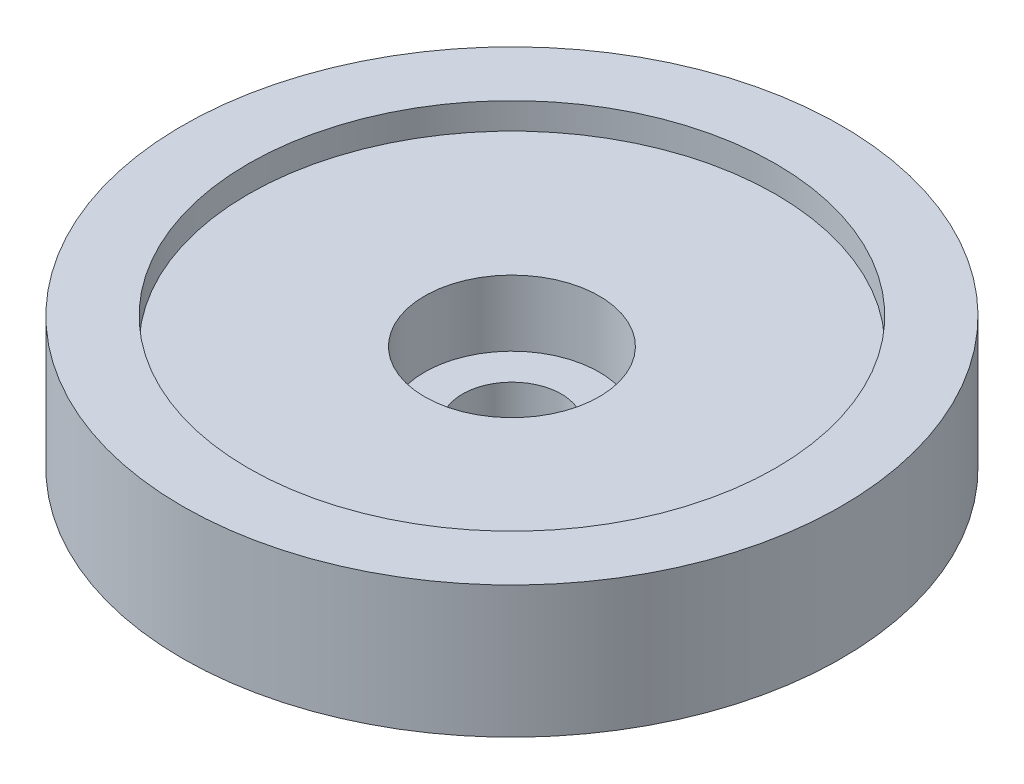
ISO-10303-21;
HEADER;
FILE_DESCRIPTION(('STEP AP214'),'2;1');
FILE_NAME('part.step','',(''),(''),'','','');
FILE_SCHEMA(('AUTOMOTIVE_DESIGN { 1 0 10303 214 1 1 1 1 }'));
ENDSEC;
DATA;
#1=APPLICATION_CONTEXT('core data for automotive mechanical design processes');
#2=APPLICATION_PROTOCOL_DEFINITION('international standard','automotive_design',2000,#1);
#3=PRODUCT_CONTEXT('',#1,'mechanical');
#4=PRODUCT('Part','Part','',(#3));
#5=PRODUCT_RELATED_PRODUCT_CATEGORY('part','',(#4));
#6=PRODUCT_DEFINITION_FORMATION('','',#4);
#7=PRODUCT_DEFINITION_CONTEXT('part definition',#1,'design');
#8=PRODUCT_DEFINITION('design','',#6,#7);
#9=PRODUCT_DEFINITION_SHAPE('','',#8);
#10=(LENGTH_UNIT() NAMED_UNIT(*) SI_UNIT(.MILLI.,.METRE.));
#11=(NAMED_UNIT(*) PLANE_ANGLE_UNIT() SI_UNIT($,.RADIAN.));
#12=(NAMED_UNIT(*) SI_UNIT($,.STERADIAN.) SOLID_ANGLE_UNIT());
#13=UNCERTAINTY_MEASURE_WITH_UNIT(LENGTH_MEASURE(1.E-05),#10,'distance_accuracy_value','');
#14=(GEOMETRIC_REPRESENTATION_CONTEXT(3) GLOBAL_UNCERTAINTY_ASSIGNED_CONTEXT((#13)) GLOBAL_UNIT_ASSIGNED_CONTEXT((#10,
#11,#12)) REPRESENTATION_CONTEXT('',''));
#15=CARTESIAN_POINT('',(0.,0.,0.));
#16=DIRECTION('',(0.,0.,1.));
#17=DIRECTION('',(1.,0.,0.));
#18=AXIS2_PLACEMENT_3D('',#15,#16,#17);
#19=CARTESIAN_POINT('',(0.,10.,0.));
#20=DIRECTION('',(0.,-1.,0.));
#21=DIRECTION('',(0.,0.,-1.));
#22=AXIS2_PLACEMENT_3D('',#19,#20,#21);
#23=CYLINDRICAL_SURFACE('',#22,25.);
#24=CARTESIAN_POINT('',(0.,10.,0.));
#25=DIRECTION('',(0.,1.,0.));
#26=DIRECTION('',(0.,0.,1.));
#27=AXIS2_PLACEMENT_3D('',#24,#25,#26);
#28=CIRCLE('',#27,25.);
#29=CARTESIAN_POINT('',(0.,10.,25.));
#30=VERTEX_POINT('',#29);
#31=EDGE_CURVE('E10',#30,#30,#28,.T.);
#32=ORIENTED_EDGE('',*,*,#31,.F.);
#33=EDGE_LOOP('',(#32));
#34=FACE_BOUND('',#33,.T.);
#35=CARTESIAN_POINT('',(0.,0.,0.));
#36=DIRECTION('',(0.,1.,0.));
#37=DIRECTION('',(0.,0.,1.));
#38=AXIS2_PLACEMENT_3D('',#35,#36,#37);
#39=CIRCLE('',#38,25.);
#40=CARTESIAN_POINT('',(0.,0.,25.));
#41=VERTEX_POINT('',#40);
#42=EDGE_CURVE('E45',#41,#41,#39,.T.);
#43=ORIENTED_EDGE('',*,*,#42,.T.);
#44=EDGE_LOOP('',(#43));
#45=FACE_BOUND('',#44,.T.);
#46=ADVANCED_FACE('F37',(#34,#45),#23,.T.);
#47=CARTESIAN_POINT('',(0.,10.,0.));
#48=DIRECTION('',(0.,1.,0.));
#49=DIRECTION('',(0.,0.,1.));
#50=AXIS2_PLACEMENT_3D('',#47,#48,#49);
#51=PLANE('',#50);
#52=CARTESIAN_POINT('',(0.,10.,0.));
#53=DIRECTION('',(0.,1.,0.));
#54=DIRECTION('',(0.,0.,1.));
#55=AXIS2_PLACEMENT_3D('',#52,#53,#54);
#56=CIRCLE('',#55,20.);
#57=CARTESIAN_POINT('',(0.,10.,20.));
#58=VERTEX_POINT('',#57);
#59=EDGE_CURVE('E53',#58,#58,#56,.T.);
#60=ORIENTED_EDGE('',*,*,#59,.F.);
#61=EDGE_LOOP('',(#60));
#62=FACE_BOUND('',#61,.T.);
#63=ORIENTED_EDGE('',*,*,#31,.T.);
#64=EDGE_LOOP('',(#63));
#65=FACE_BOUND('',#64,.T.);
#66=ADVANCED_FACE('F105',(#62,#65),#51,.T.);
#67=CARTESIAN_POINT('',(0.,0.,0.));
#68=DIRECTION('',(0.,1.,0.));
#69=DIRECTION('',(0.,0.,1.));
#70=AXIS2_PLACEMENT_3D('',#67,#68,#69);
#71=PLANE('',#70);
#72=CARTESIAN_POINT('',(0.,0.,0.));
#73=DIRECTION('',(0.,1.,0.));
#74=DIRECTION('',(0.,0.,1.));
#75=AXIS2_PLACEMENT_3D('',#72,#73,#74);
#76=CIRCLE('',#75,3.75);
#77=CARTESIAN_POINT('',(0.,0.,3.75));
#78=VERTEX_POINT('',#77);
#79=EDGE_CURVE('E68',#78,#78,#76,.T.);
#80=ORIENTED_EDGE('',*,*,#79,.T.);
#81=EDGE_LOOP('',(#80));
#82=FACE_BOUND('',#81,.T.);
#83=ORIENTED_EDGE('',*,*,#42,.F.);
#84=EDGE_LOOP('',(#83));
#85=FACE_BOUND('',#84,.T.);
#86=ADVANCED_FACE('F101',(#82,#85),#71,.F.);
#87=CARTESIAN_POINT('',(0.,8.,0.));
#88=DIRECTION('',(0.,1.,0.));
#89=DIRECTION('',(0.,0.,1.));
#90=AXIS2_PLACEMENT_3D('',#87,#88,#89);
#91=CYLINDRICAL_SURFACE('',#90,20.);
#92=CARTESIAN_POINT('',(0.,8.,0.));
#93=DIRECTION('',(0.,1.,0.));
#94=DIRECTION('',(0.,0.,1.));
#95=AXIS2_PLACEMENT_3D('',#92,#93,#94);
#96=CIRCLE('',#95,20.);
#97=CARTESIAN_POINT('',(0.,8.,20.));
#98=VERTEX_POINT('',#97);
#99=EDGE_CURVE('E51',#98,#98,#96,.T.);
#100=ORIENTED_EDGE('',*,*,#99,.F.);
#101=EDGE_LOOP('',(#100));
#102=FACE_BOUND('',#101,.T.);
#103=ORIENTED_EDGE('',*,*,#59,.T.);
#104=EDGE_LOOP('',(#103));
#105=FACE_BOUND('',#104,.T.);
#106=ADVANCED_FACE('F95',(#102,#105),#91,.F.);
#107=CARTESIAN_POINT('',(0.,8.,0.));
#108=DIRECTION('',(0.,1.,0.));
#109=DIRECTION('',(0.,0.,1.));
#110=AXIS2_PLACEMENT_3D('',#107,#108,#109);
#111=PLANE('',#110);
#112=CARTESIAN_POINT('',(0.,8.,0.));
#113=DIRECTION('',(0.,1.,0.));
#114=DIRECTION('',(0.,0.,1.));
#115=AXIS2_PLACEMENT_3D('',#112,#113,#114);
#116=CIRCLE('',#115,6.625);
#117=CARTESIAN_POINT('',(0.,8.,6.625));
#118=VERTEX_POINT('',#117);
#119=EDGE_CURVE('E61',#118,#118,#116,.T.);
#120=ORIENTED_EDGE('',*,*,#119,.F.);
#121=EDGE_LOOP('',(#120));
#122=FACE_BOUND('',#121,.T.);
#123=ORIENTED_EDGE('',*,*,#99,.T.);
#124=EDGE_LOOP('',(#123));
#125=FACE_BOUND('',#124,.T.);
#126=ADVANCED_FACE('F89',(#122,#125),#111,.T.);
#127=CARTESIAN_POINT('',(0.,3.,0.));
#128=DIRECTION('',(0.,1.,0.));
#129=DIRECTION('',(0.,0.,1.));
#130=AXIS2_PLACEMENT_3D('',#127,#128,#129);
#131=CYLINDRICAL_SURFACE('',#130,6.625);
#132=CARTESIAN_POINT('',(0.,3.,0.));
#133=DIRECTION('',(0.,1.,0.));
#134=DIRECTION('',(0.,0.,1.));
#135=AXIS2_PLACEMENT_3D('',#132,#133,#134);
#136=CIRCLE('',#135,6.625);
#137=CARTESIAN_POINT('',(0.,3.,6.625));
#138=VERTEX_POINT('',#137);
#139=EDGE_CURVE('E57',#138,#138,#136,.T.);
#140=ORIENTED_EDGE('',*,*,#139,.F.);
#141=EDGE_LOOP('',(#140));
#142=FACE_BOUND('',#141,.T.);
#143=ORIENTED_EDGE('',*,*,#119,.T.);
#144=EDGE_LOOP('',(#143));
#145=FACE_BOUND('',#144,.T.);
#146=ADVANCED_FACE('F83',(#142,#145),#131,.F.);
#147=CARTESIAN_POINT('',(0.,3.,0.));
#148=DIRECTION('',(0.,1.,0.));
#149=DIRECTION('',(0.,0.,1.));
#150=AXIS2_PLACEMENT_3D('',#147,#148,#149);
#151=PLANE('',#150);
#152=CARTESIAN_POINT('',(0.,3.,0.));
#153=DIRECTION('',(0.,1.,0.));
#154=DIRECTION('',(0.,0.,1.));
#155=AXIS2_PLACEMENT_3D('',#152,#153,#154);
#156=CIRCLE('',#155,3.75);
#157=CARTESIAN_POINT('',(0.,3.,3.75));
#158=VERTEX_POINT('',#157);
#159=EDGE_CURVE('E40',#158,#158,#156,.T.);
#160=ORIENTED_EDGE('',*,*,#159,.F.);
#161=EDGE_LOOP('',(#160));
#162=FACE_BOUND('',#161,.T.);
#163=ORIENTED_EDGE('',*,*,#139,.T.);
#164=EDGE_LOOP('',(#163));
#165=FACE_BOUND('',#164,.T.);
#166=ADVANCED_FACE('F80',(#162,#165),#151,.T.);
#167=CARTESIAN_POINT('',(0.,0.,0.));
#168=DIRECTION('',(0.,1.,0.));
#169=DIRECTION('',(0.,0.,1.));
#170=AXIS2_PLACEMENT_3D('',#167,#168,#169);
#171=CYLINDRICAL_SURFACE('',#170,3.75);
#172=ORIENTED_EDGE('',*,*,#159,.T.);
#173=EDGE_LOOP('',(#172));
#174=FACE_BOUND('',#173,.T.);
#175=ORIENTED_EDGE('',*,*,#79,.F.);
#176=EDGE_LOOP('',(#175));
#177=FACE_BOUND('',#176,.T.);
#178=ADVANCED_FACE('F77',(#174,#177),#171,.F.);
#179=CLOSED_SHELL('',(#46,#66,#86,#106,#126,#146,#166,#178));
#180=MANIFOLD_SOLID_BREP('B2',#179);
#181=ADVANCED_BREP_SHAPE_REPRESENTATION('',(#18,#180),#14);
#182=SHAPE_DEFINITION_REPRESENTATION(#9,#181);
ENDSEC;
END-ISO-10303-21;
